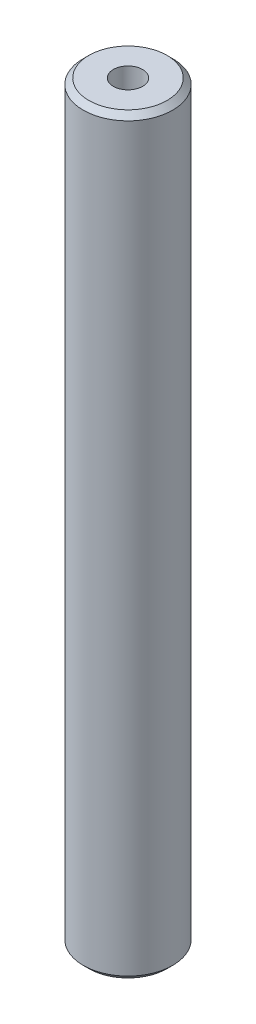
ISO-10303-21;
HEADER;
FILE_DESCRIPTION(('STEP AP214'),'2;1');
FILE_NAME('part.step','',(''),(''),'','','');
FILE_SCHEMA(('AUTOMOTIVE_DESIGN { 1 0 10303 214 1 1 1 1 }'));
ENDSEC;
DATA;
#1=APPLICATION_CONTEXT('core data for automotive mechanical design processes');
#2=APPLICATION_PROTOCOL_DEFINITION('international standard','automotive_design',2000,#1);
#3=PRODUCT_CONTEXT('',#1,'mechanical');
#4=PRODUCT('Part','Part','',(#3));
#5=PRODUCT_RELATED_PRODUCT_CATEGORY('part','',(#4));
#6=PRODUCT_DEFINITION_FORMATION('','',#4);
#7=PRODUCT_DEFINITION_CONTEXT('part definition',#1,'design');
#8=PRODUCT_DEFINITION('design','',#6,#7);
#9=PRODUCT_DEFINITION_SHAPE('','',#8);
#10=(LENGTH_UNIT() NAMED_UNIT(*) SI_UNIT(.MILLI.,.METRE.));
#11=(NAMED_UNIT(*) PLANE_ANGLE_UNIT() SI_UNIT($,.RADIAN.));
#12=(NAMED_UNIT(*) SI_UNIT($,.STERADIAN.) SOLID_ANGLE_UNIT());
#13=UNCERTAINTY_MEASURE_WITH_UNIT(LENGTH_MEASURE(1.E-05),#10,'distance_accuracy_value','');
#14=(GEOMETRIC_REPRESENTATION_CONTEXT(3) GLOBAL_UNCERTAINTY_ASSIGNED_CONTEXT((#13)) GLOBAL_UNIT_ASSIGNED_CONTEXT((#10,
#11,#12)) REPRESENTATION_CONTEXT('',''));
#15=CARTESIAN_POINT('',(0.,0.,0.));
#16=DIRECTION('',(0.,0.,1.));
#17=DIRECTION('',(1.,0.,0.));
#18=AXIS2_PLACEMENT_3D('',#15,#16,#17);
#19=CARTESIAN_POINT('',(0.,378.421910744003,0.));
#20=DIRECTION('',(0.,-1.,0.));
#21=DIRECTION('',(0.,0.,-1.));
#22=AXIS2_PLACEMENT_3D('',#19,#20,#21);
#23=CYLINDRICAL_SURFACE('',#22,22.5);
#24=CARTESIAN_POINT('',(0.,375.599774101849,0.));
#25=DIRECTION('',(0.,1.,0.));
#26=DIRECTION('',(0.,0.,1.));
#27=AXIS2_PLACEMENT_3D('',#24,#25,#26);
#28=CIRCLE('',#27,22.5);
#29=CARTESIAN_POINT('',(0.,375.599774101849,22.5));
#30=VERTEX_POINT('',#29);
#31=EDGE_CURVE('E50',#30,#30,#28,.F.);
#32=ORIENTED_EDGE('',*,*,#31,.T.);
#33=EDGE_LOOP('',(#32));
#34=FACE_BOUND('',#33,.T.);
#35=CARTESIAN_POINT('',(0.,2.82213664215447,0.));
#36=DIRECTION('',(0.,1.,0.));
#37=DIRECTION('',(0.,0.,1.));
#38=AXIS2_PLACEMENT_3D('',#35,#36,#37);
#39=CIRCLE('',#38,22.5);
#40=CARTESIAN_POINT('',(0.,2.82213664215447,22.5));
#41=VERTEX_POINT('',#40);
#42=EDGE_CURVE('E51',#41,#41,#39,.T.);
#43=ORIENTED_EDGE('',*,*,#42,.T.);
#44=EDGE_LOOP('',(#43));
#45=FACE_BOUND('',#44,.T.);
#46=ADVANCED_FACE('F39',(#34,#45),#23,.T.);
#47=CARTESIAN_POINT('',(0.,378.421910744003,0.));
#48=DIRECTION('',(0.,1.,0.));
#49=DIRECTION('',(0.,0.,1.));
#50=AXIS2_PLACEMENT_3D('',#47,#48,#49);
#51=PLANE('',#50);
#52=CARTESIAN_POINT('',(0.,378.421910744003,0.));
#53=DIRECTION('',(0.,1.,0.));
#54=DIRECTION('',(0.,0.,1.));
#55=AXIS2_PLACEMENT_3D('',#52,#53,#54);
#56=CIRCLE('',#55,19.6778633578454);
#57=CARTESIAN_POINT('',(0.,378.421910744003,19.6778633578454));
#58=VERTEX_POINT('',#57);
#59=EDGE_CURVE('E54',#58,#58,#56,.T.);
#60=ORIENTED_EDGE('',*,*,#59,.T.);
#61=EDGE_LOOP('',(#60));
#62=FACE_BOUND('',#61,.T.);
#63=CARTESIAN_POINT('',(0.,378.421910744003,0.));
#64=DIRECTION('',(0.,1.,0.));
#65=DIRECTION('',(0.,0.,1.));
#66=AXIS2_PLACEMENT_3D('',#63,#64,#65);
#67=CIRCLE('',#66,7.37480846444745);
#68=CARTESIAN_POINT('',(0.,378.421910744003,7.37480846444745));
#69=VERTEX_POINT('',#68);
#70=EDGE_CURVE('E58',#69,#69,#67,.T.);
#71=ORIENTED_EDGE('',*,*,#70,.F.);
#72=EDGE_LOOP('',(#71));
#73=FACE_BOUND('',#72,.T.);
#74=ADVANCED_FACE('F69',(#62,#73),#51,.T.);
#75=CARTESIAN_POINT('',(0.,0.,0.));
#76=DIRECTION('',(0.,1.,0.));
#77=DIRECTION('',(0.,0.,1.));
#78=AXIS2_PLACEMENT_3D('',#75,#76,#77);
#79=PLANE('',#78);
#80=CARTESIAN_POINT('',(0.,0.,0.));
#81=DIRECTION('',(0.,1.,0.));
#82=DIRECTION('',(0.,0.,1.));
#83=AXIS2_PLACEMENT_3D('',#80,#81,#82);
#84=CIRCLE('',#83,19.6778633578455);
#85=CARTESIAN_POINT('',(0.,0.,19.6778633578455));
#86=VERTEX_POINT('',#85);
#87=EDGE_CURVE('E10',#86,#86,#84,.F.);
#88=ORIENTED_EDGE('',*,*,#87,.T.);
#89=EDGE_LOOP('',(#88));
#90=FACE_BOUND('',#89,.T.);
#91=CARTESIAN_POINT('',(0.,0.,0.));
#92=DIRECTION('',(0.,1.,0.));
#93=DIRECTION('',(0.,0.,1.));
#94=AXIS2_PLACEMENT_3D('',#91,#92,#93);
#95=CIRCLE('',#94,7.37480846444745);
#96=CARTESIAN_POINT('',(0.,0.,7.37480846444745));
#97=VERTEX_POINT('',#96);
#98=EDGE_CURVE('E63',#97,#97,#95,.T.);
#99=ORIENTED_EDGE('',*,*,#98,.T.);
#100=EDGE_LOOP('',(#99));
#101=FACE_BOUND('',#100,.T.);
#102=ADVANCED_FACE('F75',(#90,#101),#79,.F.);
#103=CARTESIAN_POINT('',(0.,378.421910744003,0.));
#104=DIRECTION('',(0.,-1.,0.));
#105=DIRECTION('',(0.,0.,-1.));
#106=AXIS2_PLACEMENT_3D('',#103,#104,#105);
#107=CYLINDRICAL_SURFACE('',#106,7.37480846444745);
#108=ORIENTED_EDGE('',*,*,#70,.T.);
#109=EDGE_LOOP('',(#108));
#110=FACE_BOUND('',#109,.T.);
#111=ORIENTED_EDGE('',*,*,#98,.F.);
#112=EDGE_LOOP('',(#111));
#113=FACE_BOUND('',#112,.T.);
#114=ADVANCED_FACE('F70',(#110,#113),#107,.F.);
#115=CARTESIAN_POINT('',(0.,378.421910744003,0.));
#116=DIRECTION('',(0.,-1.,0.));
#117=DIRECTION('',(0.,0.,-1.));
#118=AXIS2_PLACEMENT_3D('',#115,#116,#117);
#119=CONICAL_SURFACE('',#118,19.6778633578454,0.785398163397445);
#120=ORIENTED_EDGE('',*,*,#31,.F.);
#121=EDGE_LOOP('',(#120));
#122=FACE_BOUND('',#121,.T.);
#123=ORIENTED_EDGE('',*,*,#59,.F.);
#124=EDGE_LOOP('',(#123));
#125=FACE_BOUND('',#124,.T.);
#126=ADVANCED_FACE('F81',(#122,#125),#119,.T.);
#127=CARTESIAN_POINT('',(0.,2.82213664215447,0.));
#128=DIRECTION('',(0.,1.,0.));
#129=DIRECTION('',(0.,0.,1.));
#130=AXIS2_PLACEMENT_3D('',#127,#128,#129);
#131=CONICAL_SURFACE('',#130,22.5,0.785398163397446);
#132=ORIENTED_EDGE('',*,*,#87,.F.);
#133=EDGE_LOOP('',(#132));
#134=FACE_BOUND('',#133,.T.);
#135=ORIENTED_EDGE('',*,*,#42,.F.);
#136=EDGE_LOOP('',(#135));
#137=FACE_BOUND('',#136,.T.);
#138=ADVANCED_FACE('F45',(#134,#137),#131,.T.);
#139=CLOSED_SHELL('',(#46,#74,#102,#114,#126,#138));
#140=MANIFOLD_SOLID_BREP('B2',#139);
#141=ADVANCED_BREP_SHAPE_REPRESENTATION('',(#18,#140),#14);
#142=SHAPE_DEFINITION_REPRESENTATION(#9,#141);
ENDSEC;
END-ISO-10303-21;
